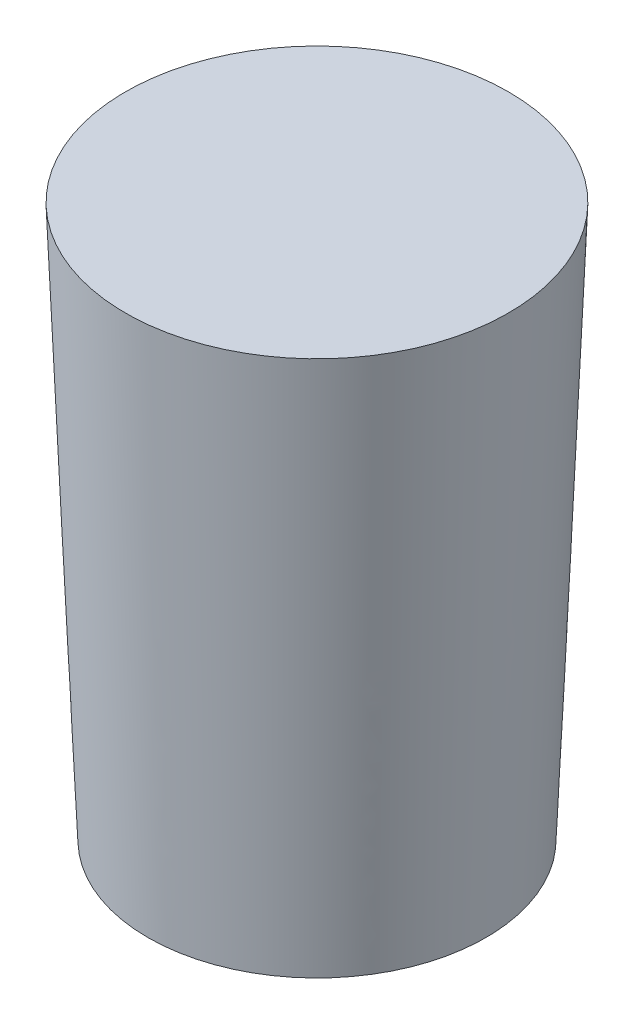
ISO-10303-21;
HEADER;
FILE_DESCRIPTION(('STEP AP214'),'2;1');
FILE_NAME('part.step','',(''),(''),'','','');
FILE_SCHEMA(('AUTOMOTIVE_DESIGN { 1 0 10303 214 1 1 1 1 }'));
ENDSEC;
DATA;
#1=APPLICATION_CONTEXT('core data for automotive mechanical design processes');
#2=APPLICATION_PROTOCOL_DEFINITION('international standard','automotive_design',2000,#1);
#3=PRODUCT_CONTEXT('',#1,'mechanical');
#4=PRODUCT('Part','Part','',(#3));
#5=PRODUCT_RELATED_PRODUCT_CATEGORY('part','',(#4));
#6=PRODUCT_DEFINITION_FORMATION('','',#4);
#7=PRODUCT_DEFINITION_CONTEXT('part definition',#1,'design');
#8=PRODUCT_DEFINITION('design','',#6,#7);
#9=PRODUCT_DEFINITION_SHAPE('','',#8);
#10=(LENGTH_UNIT() NAMED_UNIT(*) SI_UNIT(.MILLI.,.METRE.));
#11=(NAMED_UNIT(*) PLANE_ANGLE_UNIT() SI_UNIT($,.RADIAN.));
#12=(NAMED_UNIT(*) SI_UNIT($,.STERADIAN.) SOLID_ANGLE_UNIT());
#13=UNCERTAINTY_MEASURE_WITH_UNIT(LENGTH_MEASURE(1.E-05),#10,'distance_accuracy_value','');
#14=(GEOMETRIC_REPRESENTATION_CONTEXT(3) GLOBAL_UNCERTAINTY_ASSIGNED_CONTEXT((#13)) GLOBAL_UNIT_ASSIGNED_CONTEXT((#10,
#11,#12)) REPRESENTATION_CONTEXT('',''));
#15=CARTESIAN_POINT('',(0.,0.,0.));
#16=DIRECTION('',(0.,0.,1.));
#17=DIRECTION('',(1.,0.,0.));
#18=AXIS2_PLACEMENT_3D('',#15,#16,#17);
#19=CARTESIAN_POINT('',(-34.,94.,0.));
#20=CARTESIAN_POINT('',(-32.0960093418703,44.9960860620151,0.));
#21=CARTESIAN_POINT('',(-30.,-4.,0.));
#22=B_SPLINE_CURVE_WITH_KNOTS('',2,(#19,#20,#21),.UNSPECIFIED.,.F.,.F.,(3,3),(0.,1.),.UNSPECIFIED.);
#23=CARTESIAN_POINT('',(0.,0.,0.));
#24=DIRECTION('',(0.,-1.,0.));
#25=AXIS1_PLACEMENT('',#23,#24);
#26=SURFACE_OF_REVOLUTION('',#22,#25);
#27=CARTESIAN_POINT('',(0.,-3.99999999999998,0.));
#28=DIRECTION('',(0.,-1.,0.));
#29=DIRECTION('',(0.,0.,-1.));
#30=AXIS2_PLACEMENT_3D('',#27,#28,#29);
#31=CIRCLE('',#30,30.);
#32=CARTESIAN_POINT('',(0.,-3.99999999999998,-30.));
#33=VERTEX_POINT('',#32);
#34=EDGE_CURVE('E11',#33,#33,#31,.T.);
#35=ORIENTED_EDGE('',*,*,#34,.F.);
#36=EDGE_LOOP('',(#35));
#37=FACE_BOUND('',#36,.T.);
#38=CARTESIAN_POINT('',(0.,94.,0.));
#39=DIRECTION('',(0.,-1.,0.));
#40=DIRECTION('',(0.,0.,-1.));
#41=AXIS2_PLACEMENT_3D('',#38,#39,#40);
#42=CIRCLE('',#41,34.);
#43=CARTESIAN_POINT('',(0.,94.,-34.));
#44=VERTEX_POINT('',#43);
#45=EDGE_CURVE('E43',#44,#44,#42,.T.);
#46=ORIENTED_EDGE('',*,*,#45,.T.);
#47=EDGE_LOOP('',(#46));
#48=FACE_BOUND('',#47,.T.);
#49=ADVANCED_FACE('F36',(#37,#48),#26,.T.);
#50=CARTESIAN_POINT('',(0.,-149.925612723299,4.72341502977315));
#51=DIRECTION('',(-1.,0.,0.));
#52=DIRECTION('',(0.,0.,-1.));
#53=AXIS2_PLACEMENT_3D('',#50,#51,#52);
#54=CIRCLE('',#53,150.);
#55=TRIMMED_CURVE('',#54,(PARAMETER_VALUE(-1.53930168686761)),
(PARAMETER_VALUE(1.53930168686761)),.T.,.PARAMETER.);
#56=CARTESIAN_POINT('',(0.,-149.925612723299,0.));
#57=DIRECTION('',(0.,-1.,0.));
#58=AXIS1_PLACEMENT('',#56,#57);
#59=SURFACE_OF_REVOLUTION('',#55,#58);
#60=CARTESIAN_POINT('',(0.,0.,0.));
#61=VERTEX_POINT('',#60);
#62=VERTEX_LOOP('',#61);
#63=FACE_BOUND('',#62,.T.);
#64=ORIENTED_EDGE('',*,*,#34,.T.);
#65=EDGE_LOOP('',(#64));
#66=FACE_BOUND('',#65,.T.);
#67=ADVANCED_FACE('F46',(#63,#66),#59,.F.);
#68=CARTESIAN_POINT('',(0.,94.,0.));
#69=DIRECTION('',(0.,-1.,0.));
#70=DIRECTION('',(0.,0.,-1.));
#71=AXIS2_PLACEMENT_3D('',#68,#69,#70);
#72=PLANE('',#71);
#73=ORIENTED_EDGE('',*,*,#45,.F.);
#74=EDGE_LOOP('',(#73));
#75=FACE_BOUND('',#74,.T.);
#76=ADVANCED_FACE('F49',(#75),#72,.F.);
#77=CLOSED_SHELL('',(#49,#67,#76));
#78=MANIFOLD_SOLID_BREP('B2',#77);
#79=ADVANCED_BREP_SHAPE_REPRESENTATION('',(#18,#78),#14);
#80=SHAPE_DEFINITION_REPRESENTATION(#9,#79);
ENDSEC;
END-ISO-10303-21;
